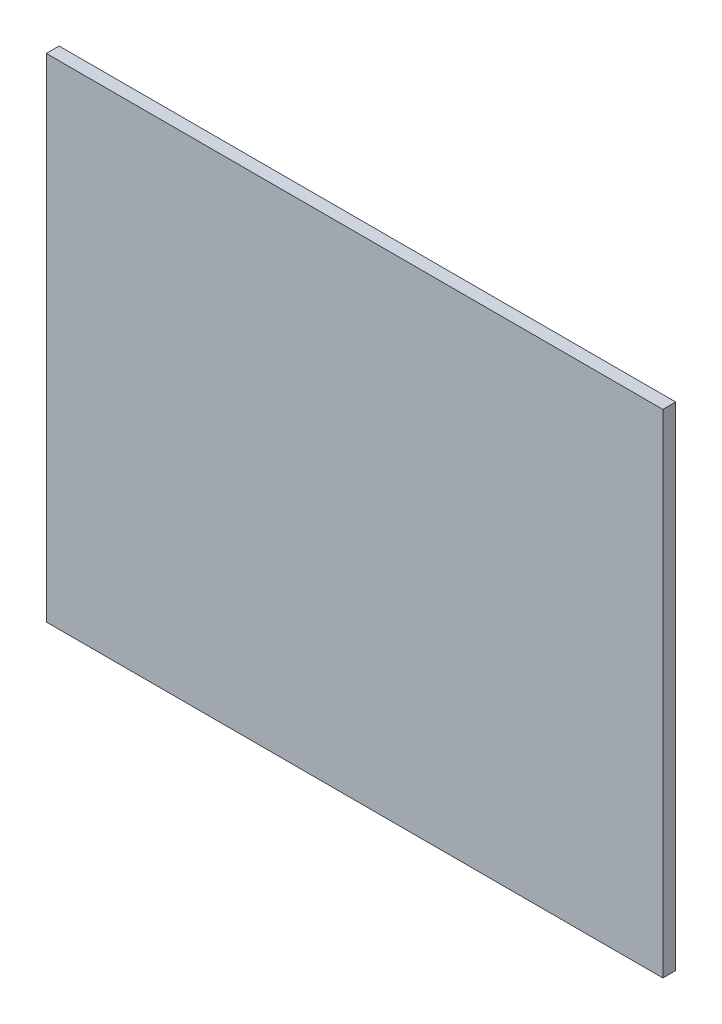
ISO-10303-21;
HEADER;
FILE_DESCRIPTION(('STEP AP214'),'2;1');
FILE_NAME('part.step','',(''),(''),'','','');
FILE_SCHEMA(('AUTOMOTIVE_DESIGN { 1 0 10303 214 1 1 1 1 }'));
ENDSEC;
DATA;
#1=APPLICATION_CONTEXT('core data for automotive mechanical design processes');
#2=APPLICATION_PROTOCOL_DEFINITION('international standard','automotive_design',2000,#1);
#3=PRODUCT_CONTEXT('',#1,'mechanical');
#4=PRODUCT('Part','Part','',(#3));
#5=PRODUCT_RELATED_PRODUCT_CATEGORY('part','',(#4));
#6=PRODUCT_DEFINITION_FORMATION('','',#4);
#7=PRODUCT_DEFINITION_CONTEXT('part definition',#1,'design');
#8=PRODUCT_DEFINITION('design','',#6,#7);
#9=PRODUCT_DEFINITION_SHAPE('','',#8);
#10=(LENGTH_UNIT() NAMED_UNIT(*) SI_UNIT(.MILLI.,.METRE.));
#11=(NAMED_UNIT(*) PLANE_ANGLE_UNIT() SI_UNIT($,.RADIAN.));
#12=(NAMED_UNIT(*) SI_UNIT($,.STERADIAN.) SOLID_ANGLE_UNIT());
#13=UNCERTAINTY_MEASURE_WITH_UNIT(LENGTH_MEASURE(1.E-05),#10,'distance_accuracy_value','');
#14=(GEOMETRIC_REPRESENTATION_CONTEXT(3) GLOBAL_UNCERTAINTY_ASSIGNED_CONTEXT((#13)) GLOBAL_UNIT_ASSIGNED_CONTEXT((#10,
#11,#12)) REPRESENTATION_CONTEXT('',''));
#15=CARTESIAN_POINT('',(0.,0.,0.));
#16=DIRECTION('',(0.,0.,1.));
#17=DIRECTION('',(1.,0.,0.));
#18=AXIS2_PLACEMENT_3D('',#15,#16,#17);
#19=CARTESIAN_POINT('',(0.,0.,6.));
#20=DIRECTION('',(1.,0.,0.));
#21=DIRECTION('',(0.,0.,-1.));
#22=AXIS2_PLACEMENT_3D('',#19,#20,#21);
#23=PLANE('',#22);
#24=DIRECTION('',(0.,-1.,0.));
#25=VECTOR('',#24,1.);
#26=CARTESIAN_POINT('',(0.,0.,0.));
#27=LINE('',#26,#25);
#28=CARTESIAN_POINT('',(0.,230.,0.));
#29=VERTEX_POINT('',#28);
#30=CARTESIAN_POINT('',(0.,0.,0.));
#31=VERTEX_POINT('',#30);
#32=EDGE_CURVE('E101',#29,#31,#27,.T.);
#33=ORIENTED_EDGE('',*,*,#32,.T.);
#34=DIRECTION('',(0.,0.,-1.));
#35=VECTOR('',#34,1.);
#36=CARTESIAN_POINT('',(0.,0.,6.));
#37=LINE('',#36,#35);
#38=CARTESIAN_POINT('',(0.,0.,6.));
#39=VERTEX_POINT('',#38);
#40=EDGE_CURVE('E11',#39,#31,#37,.T.);
#41=ORIENTED_EDGE('',*,*,#40,.F.);
#42=DIRECTION('',(0.,-1.,0.));
#43=VECTOR('',#42,1.);
#44=CARTESIAN_POINT('',(0.,0.,6.));
#45=LINE('',#44,#43);
#46=CARTESIAN_POINT('',(0.,230.,6.));
#47=VERTEX_POINT('',#46);
#48=EDGE_CURVE('E89',#47,#39,#45,.T.);
#49=ORIENTED_EDGE('',*,*,#48,.F.);
#50=DIRECTION('',(0.,0.,-1.));
#51=VECTOR('',#50,1.);
#52=CARTESIAN_POINT('',(0.,230.,6.));
#53=LINE('',#52,#51);
#54=EDGE_CURVE('E97',#47,#29,#53,.T.);
#55=ORIENTED_EDGE('',*,*,#54,.T.);
#56=EDGE_LOOP('',(#33,#41,#49,#55));
#57=FACE_BOUND('',#56,.T.);
#58=ADVANCED_FACE('F38',(#57),#23,.F.);
#59=CARTESIAN_POINT('',(0.,0.,6.));
#60=DIRECTION('',(0.,1.,0.));
#61=DIRECTION('',(0.,0.,1.));
#62=AXIS2_PLACEMENT_3D('',#59,#60,#61);
#63=PLANE('',#62);
#64=DIRECTION('',(1.,0.,0.));
#65=VECTOR('',#64,1.);
#66=CARTESIAN_POINT('',(0.,0.,0.));
#67=LINE('',#66,#65);
#68=CARTESIAN_POINT('',(288.,0.,0.));
#69=VERTEX_POINT('',#68);
#70=EDGE_CURVE('E93',#31,#69,#67,.T.);
#71=ORIENTED_EDGE('',*,*,#70,.T.);
#72=DIRECTION('',(0.,0.,-1.));
#73=VECTOR('',#72,1.);
#74=CARTESIAN_POINT('',(288.,0.,6.));
#75=LINE('',#74,#73);
#76=CARTESIAN_POINT('',(288.,0.,6.));
#77=VERTEX_POINT('',#76);
#78=EDGE_CURVE('E46',#77,#69,#75,.T.);
#79=ORIENTED_EDGE('',*,*,#78,.F.);
#80=DIRECTION('',(1.,0.,0.));
#81=VECTOR('',#80,1.);
#82=CARTESIAN_POINT('',(0.,0.,6.));
#83=LINE('',#82,#81);
#84=EDGE_CURVE('E84',#39,#77,#83,.T.);
#85=ORIENTED_EDGE('',*,*,#84,.F.);
#86=ORIENTED_EDGE('',*,*,#40,.T.);
#87=EDGE_LOOP('',(#71,#79,#85,#86));
#88=FACE_BOUND('',#87,.T.);
#89=ADVANCED_FACE('F92',(#88),#63,.F.);
#90=CARTESIAN_POINT('',(288.,0.,6.));
#91=DIRECTION('',(-1.,0.,0.));
#92=DIRECTION('',(0.,0.,1.));
#93=AXIS2_PLACEMENT_3D('',#90,#91,#92);
#94=PLANE('',#93);
#95=DIRECTION('',(0.,1.,0.));
#96=VECTOR('',#95,1.);
#97=CARTESIAN_POINT('',(288.,0.,0.));
#98=LINE('',#97,#96);
#99=CARTESIAN_POINT('',(288.,230.,0.));
#100=VERTEX_POINT('',#99);
#101=EDGE_CURVE('E71',#69,#100,#98,.T.);
#102=ORIENTED_EDGE('',*,*,#101,.T.);
#103=DIRECTION('',(0.,0.,-1.));
#104=VECTOR('',#103,1.);
#105=CARTESIAN_POINT('',(288.,230.,6.));
#106=LINE('',#105,#104);
#107=CARTESIAN_POINT('',(288.,230.,6.));
#108=VERTEX_POINT('',#107);
#109=EDGE_CURVE('E94',#108,#100,#106,.T.);
#110=ORIENTED_EDGE('',*,*,#109,.F.);
#111=DIRECTION('',(0.,1.,0.));
#112=VECTOR('',#111,1.);
#113=CARTESIAN_POINT('',(288.,0.,6.));
#114=LINE('',#113,#112);
#115=EDGE_CURVE('E87',#77,#108,#114,.T.);
#116=ORIENTED_EDGE('',*,*,#115,.F.);
#117=ORIENTED_EDGE('',*,*,#78,.T.);
#118=EDGE_LOOP('',(#102,#110,#116,#117));
#119=FACE_BOUND('',#118,.T.);
#120=ADVANCED_FACE('F95',(#119),#94,.F.);
#121=CARTESIAN_POINT('',(0.,230.,6.));
#122=DIRECTION('',(0.,-1.,0.));
#123=DIRECTION('',(0.,0.,-1.));
#124=AXIS2_PLACEMENT_3D('',#121,#122,#123);
#125=PLANE('',#124);
#126=DIRECTION('',(-1.,0.,0.));
#127=VECTOR('',#126,1.);
#128=CARTESIAN_POINT('',(0.,230.,0.));
#129=LINE('',#128,#127);
#130=EDGE_CURVE('E77',#100,#29,#129,.T.);
#131=ORIENTED_EDGE('',*,*,#130,.T.);
#132=ORIENTED_EDGE('',*,*,#54,.F.);
#133=DIRECTION('',(-1.,0.,0.));
#134=VECTOR('',#133,1.);
#135=CARTESIAN_POINT('',(0.,230.,6.));
#136=LINE('',#135,#134);
#137=EDGE_CURVE('E54',#108,#47,#136,.T.);
#138=ORIENTED_EDGE('',*,*,#137,.F.);
#139=ORIENTED_EDGE('',*,*,#109,.T.);
#140=EDGE_LOOP('',(#131,#132,#138,#139));
#141=FACE_BOUND('',#140,.T.);
#142=ADVANCED_FACE('F108',(#141),#125,.F.);
#143=CARTESIAN_POINT('',(0.,0.,6.));
#144=DIRECTION('',(0.,0.,-1.));
#145=DIRECTION('',(-1.,0.,0.));
#146=AXIS2_PLACEMENT_3D('',#143,#144,#145);
#147=PLANE('',#146);
#148=ORIENTED_EDGE('',*,*,#48,.T.);
#149=ORIENTED_EDGE('',*,*,#84,.T.);
#150=ORIENTED_EDGE('',*,*,#115,.T.);
#151=ORIENTED_EDGE('',*,*,#137,.T.);
#152=EDGE_LOOP('',(#148,#149,#150,#151));
#153=FACE_BOUND('',#152,.T.);
#154=ADVANCED_FACE('F85',(#153),#147,.F.);
#155=CARTESIAN_POINT('',(0.,0.,0.));
#156=DIRECTION('',(0.,0.,-1.));
#157=DIRECTION('',(-1.,0.,0.));
#158=AXIS2_PLACEMENT_3D('',#155,#156,#157);
#159=PLANE('',#158);
#160=ORIENTED_EDGE('',*,*,#32,.F.);
#161=ORIENTED_EDGE('',*,*,#130,.F.);
#162=ORIENTED_EDGE('',*,*,#101,.F.);
#163=ORIENTED_EDGE('',*,*,#70,.F.);
#164=EDGE_LOOP('',(#160,#161,#162,#163));
#165=FACE_BOUND('',#164,.T.);
#166=ADVANCED_FACE('F111',(#165),#159,.T.);
#167=CLOSED_SHELL('',(#58,#89,#120,#142,#154,#166));
#168=MANIFOLD_SOLID_BREP('B2',#167);
#169=ADVANCED_BREP_SHAPE_REPRESENTATION('',(#18,#168),#14);
#170=SHAPE_DEFINITION_REPRESENTATION(#9,#169);
ENDSEC;
END-ISO-10303-21;
